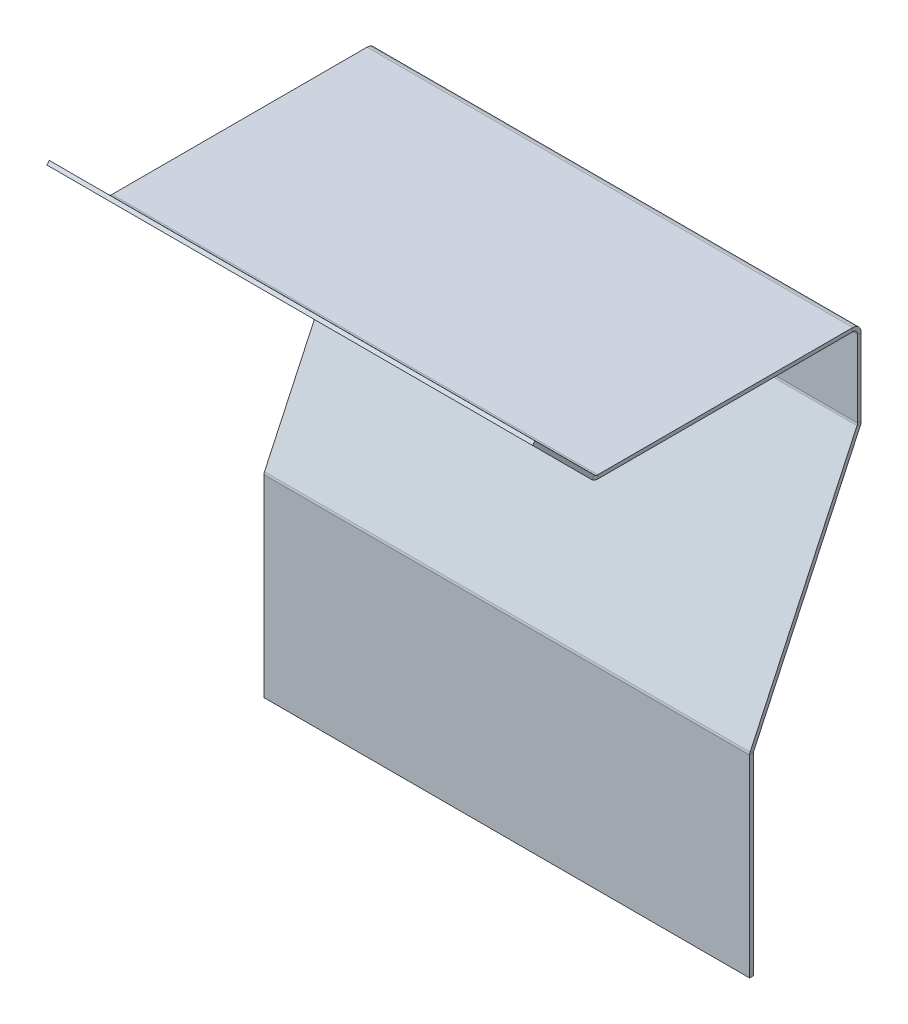
ISO-10303-21;
HEADER;
FILE_DESCRIPTION(('STEP AP214'),'2;1');
FILE_NAME('part.step','',(''),(''),'','','');
FILE_SCHEMA(('AUTOMOTIVE_DESIGN { 1 0 10303 214 1 1 1 1 }'));
ENDSEC;
DATA;
#1=APPLICATION_CONTEXT('core data for automotive mechanical design processes');
#2=APPLICATION_PROTOCOL_DEFINITION('international standard','automotive_design',2000,#1);
#3=PRODUCT_CONTEXT('',#1,'mechanical');
#4=PRODUCT('Part','Part','',(#3));
#5=PRODUCT_RELATED_PRODUCT_CATEGORY('part','',(#4));
#6=PRODUCT_DEFINITION_FORMATION('','',#4);
#7=PRODUCT_DEFINITION_CONTEXT('part definition',#1,'design');
#8=PRODUCT_DEFINITION('design','',#6,#7);
#9=PRODUCT_DEFINITION_SHAPE('','',#8);
#10=(LENGTH_UNIT() NAMED_UNIT(*) SI_UNIT(.MILLI.,.METRE.));
#11=(NAMED_UNIT(*) PLANE_ANGLE_UNIT() SI_UNIT($,.RADIAN.));
#12=(NAMED_UNIT(*) SI_UNIT($,.STERADIAN.) SOLID_ANGLE_UNIT());
#13=UNCERTAINTY_MEASURE_WITH_UNIT(LENGTH_MEASURE(1.E-05),#10,'distance_accuracy_value','');
#14=(GEOMETRIC_REPRESENTATION_CONTEXT(3) GLOBAL_UNCERTAINTY_ASSIGNED_CONTEXT((#13)) GLOBAL_UNIT_ASSIGNED_CONTEXT((#10,
#11,#12)) REPRESENTATION_CONTEXT('',''));
#15=CARTESIAN_POINT('',(0.,0.,0.));
#16=DIRECTION('',(0.,0.,1.));
#17=DIRECTION('',(1.,0.,0.));
#18=AXIS2_PLACEMENT_3D('',#15,#16,#17);
#19=CARTESIAN_POINT('',(100.,-1.524,52.5));
#20=DIRECTION('',(1.,0.,0.));
#21=DIRECTION('',(0.,0.,-1.));
#22=AXIS2_PLACEMENT_3D('',#19,#20,#21);
#23=PLANE('',#22);
#24=DIRECTION('',(0.,0.,-1.));
#25=VECTOR('',#24,1.);
#26=CARTESIAN_POINT('',(100.,0.,52.5));
#27=LINE('',#26,#25);
#28=CARTESIAN_POINT('',(100.,0.,52.5));
#29=VERTEX_POINT('',#28);
#30=CARTESIAN_POINT('',(100.,0.,-52.5));
#31=VERTEX_POINT('',#30);
#32=EDGE_CURVE('E205',#29,#31,#27,.T.);
#33=ORIENTED_EDGE('',*,*,#32,.F.);
#34=DIRECTION('',(0.,1.,0.));
#35=VECTOR('',#34,1.);
#36=CARTESIAN_POINT('',(100.,-1.524,52.5));
#37=LINE('',#36,#35);
#38=CARTESIAN_POINT('',(100.,-1.52400000000003,52.5));
#39=VERTEX_POINT('',#38);
#40=EDGE_CURVE('E13',#39,#29,#37,.T.);
#41=ORIENTED_EDGE('',*,*,#40,.F.);
#42=DIRECTION('',(0.,0.,-1.));
#43=VECTOR('',#42,1.);
#44=CARTESIAN_POINT('',(100.,-1.524,52.5));
#45=LINE('',#44,#43);
#46=CARTESIAN_POINT('',(100.,-1.524,-52.5));
#47=VERTEX_POINT('',#46);
#48=EDGE_CURVE('E181',#39,#47,#45,.T.);
#49=ORIENTED_EDGE('',*,*,#48,.T.);
#50=DIRECTION('',(0.,1.,0.));
#51=VECTOR('',#50,1.);
#52=CARTESIAN_POINT('',(100.,-1.524,-52.5));
#53=LINE('',#52,#51);
#54=EDGE_CURVE('E125',#47,#31,#53,.T.);
#55=ORIENTED_EDGE('',*,*,#54,.T.);
#56=EDGE_LOOP('',(#33,#41,#49,#55));
#57=FACE_BOUND('',#56,.T.);
#58=ADVANCED_FACE('F122',(#57),#23,.T.);
#59=CARTESIAN_POINT('',(-100.,-1.524,52.5));
#60=DIRECTION('',(-1.,0.,0.));
#61=DIRECTION('',(0.,0.,1.));
#62=AXIS2_PLACEMENT_3D('',#59,#60,#61);
#63=PLANE('',#62);
#64=DIRECTION('',(0.,0.,1.));
#65=VECTOR('',#64,1.);
#66=CARTESIAN_POINT('',(-100.,0.,52.5));
#67=LINE('',#66,#65);
#68=CARTESIAN_POINT('',(-100.,0.,-52.5));
#69=VERTEX_POINT('',#68);
#70=CARTESIAN_POINT('',(-100.,0.,52.5));
#71=VERTEX_POINT('',#70);
#72=EDGE_CURVE('E154',#69,#71,#67,.T.);
#73=ORIENTED_EDGE('',*,*,#72,.F.);
#74=DIRECTION('',(0.,1.,0.));
#75=VECTOR('',#74,1.);
#76=CARTESIAN_POINT('',(-100.,-1.524,-52.5));
#77=LINE('',#76,#75);
#78=CARTESIAN_POINT('',(-100.,-1.524,-52.5));
#79=VERTEX_POINT('',#78);
#80=EDGE_CURVE('E160',#79,#69,#77,.T.);
#81=ORIENTED_EDGE('',*,*,#80,.F.);
#82=DIRECTION('',(0.,0.,1.));
#83=VECTOR('',#82,1.);
#84=CARTESIAN_POINT('',(-100.,-1.524,52.5));
#85=LINE('',#84,#83);
#86=CARTESIAN_POINT('',(-100.,-1.524,52.5));
#87=VERTEX_POINT('',#86);
#88=EDGE_CURVE('E139',#79,#87,#85,.T.);
#89=ORIENTED_EDGE('',*,*,#88,.T.);
#90=DIRECTION('',(0.,1.,0.));
#91=VECTOR('',#90,1.);
#92=CARTESIAN_POINT('',(-100.,-1.524,52.5));
#93=LINE('',#92,#91);
#94=EDGE_CURVE('E131',#87,#71,#93,.T.);
#95=ORIENTED_EDGE('',*,*,#94,.T.);
#96=EDGE_LOOP('',(#73,#81,#89,#95));
#97=FACE_BOUND('',#96,.T.);
#98=ADVANCED_FACE('F153',(#97),#63,.T.);
#99=CARTESIAN_POINT('',(0.,-1.524,0.));
#100=DIRECTION('',(0.,-1.,0.));
#101=DIRECTION('',(0.,0.,-1.));
#102=AXIS2_PLACEMENT_3D('',#99,#100,#101);
#103=PLANE('',#102);
#104=ORIENTED_EDGE('',*,*,#48,.F.);
#105=DIRECTION('',(1.,0.,0.));
#106=VECTOR('',#105,1.);
#107=CARTESIAN_POINT('',(-100.,-1.524,52.5));
#108=LINE('',#107,#106);
#109=EDGE_CURVE('E202',#87,#39,#108,.T.);
#110=ORIENTED_EDGE('',*,*,#109,.F.);
#111=ORIENTED_EDGE('',*,*,#88,.F.);
#112=DIRECTION('',(-1.,0.,0.));
#113=VECTOR('',#112,1.);
#114=CARTESIAN_POINT('',(-100.,-1.524,-52.5));
#115=LINE('',#114,#113);
#116=EDGE_CURVE('E198',#47,#79,#115,.T.);
#117=ORIENTED_EDGE('',*,*,#116,.F.);
#118=EDGE_LOOP('',(#104,#110,#111,#117));
#119=FACE_BOUND('',#118,.T.);
#120=ADVANCED_FACE('F245',(#119),#103,.T.);
#121=CARTESIAN_POINT('',(0.,0.,0.));
#122=DIRECTION('',(0.,-1.,0.));
#123=DIRECTION('',(0.,0.,-1.));
#124=AXIS2_PLACEMENT_3D('',#121,#122,#123);
#125=PLANE('',#124);
#126=ORIENTED_EDGE('',*,*,#32,.T.);
#127=DIRECTION('',(-1.,0.,0.));
#128=VECTOR('',#127,1.);
#129=CARTESIAN_POINT('',(-100.,0.,-52.5));
#130=LINE('',#129,#128);
#131=EDGE_CURVE('E169',#31,#69,#130,.T.);
#132=ORIENTED_EDGE('',*,*,#131,.T.);
#133=ORIENTED_EDGE('',*,*,#72,.T.);
#134=DIRECTION('',(1.,0.,0.));
#135=VECTOR('',#134,1.);
#136=CARTESIAN_POINT('',(-100.,0.,52.5));
#137=LINE('',#136,#135);
#138=EDGE_CURVE('E167',#71,#29,#137,.T.);
#139=ORIENTED_EDGE('',*,*,#138,.T.);
#140=EDGE_LOOP('',(#126,#132,#133,#139));
#141=FACE_BOUND('',#140,.T.);
#142=ADVANCED_FACE('F166',(#141),#125,.F.);
#143=CARTESIAN_POINT('',(-100.,1.98119999999999,52.5));
#144=DIRECTION('',(-1.,0.,0.));
#145=DIRECTION('',(0.,-1.,0.));
#146=AXIS2_PLACEMENT_3D('',#143,#144,#145);
#147=PLANE('',#146);
#148=DIRECTION('',(0.,0.707106781186551,-0.707106781186544));
#149=VECTOR('',#148,1.);
#150=CARTESIAN_POINT('',(-100.,-0.49735068941511,54.978550689415));
#151=LINE('',#150,#149);
#152=CARTESIAN_POINT('',(-100.,0.580280045113193,53.9009199548868));
#153=VERTEX_POINT('',#152);
#154=CARTESIAN_POINT('',(-100.,-0.497350689415108,54.9785506894151));
#155=VERTEX_POINT('',#154);
#156=EDGE_CURVE('E186',#153,#155,#151,.F.);
#157=ORIENTED_EDGE('',*,*,#156,.F.);
#158=CARTESIAN_POINT('',(-100.,1.98119999999999,52.5));
#159=DIRECTION('',(1.,0.,0.));
#160=DIRECTION('',(0.,1.,0.));
#161=AXIS2_PLACEMENT_3D('',#158,#159,#160);
#162=CIRCLE('',#161,1.98120000000001);
#163=EDGE_CURVE('E177',#71,#153,#162,.F.);
#164=ORIENTED_EDGE('',*,*,#163,.F.);
#165=ORIENTED_EDGE('',*,*,#94,.F.);
#166=CARTESIAN_POINT('',(-100.,1.98119999999999,52.5));
#167=DIRECTION('',(1.,0.,0.));
#168=DIRECTION('',(0.,1.,0.));
#169=AXIS2_PLACEMENT_3D('',#166,#167,#168);
#170=CIRCLE('',#169,3.50520000000001);
#171=EDGE_CURVE('E190',#87,#155,#170,.F.);
#172=ORIENTED_EDGE('',*,*,#171,.T.);
#173=EDGE_LOOP('',(#157,#164,#165,#172));
#174=FACE_BOUND('',#173,.T.);
#175=ADVANCED_FACE('F184',(#174),#147,.T.);
#176=CARTESIAN_POINT('',(100.,1.98119999999997,52.5));
#177=DIRECTION('',(-1.,0.,0.));
#178=DIRECTION('',(0.,-1.,0.));
#179=AXIS2_PLACEMENT_3D('',#176,#177,#178);
#180=PLANE('',#179);
#181=CARTESIAN_POINT('',(100.,1.98119999999997,52.5));
#182=DIRECTION('',(1.,0.,0.));
#183=DIRECTION('',(0.,1.,0.));
#184=AXIS2_PLACEMENT_3D('',#181,#182,#183);
#185=CIRCLE('',#184,1.98120000000001);
#186=CARTESIAN_POINT('',(100.,0.580280045113173,53.9009199548868));
#187=VERTEX_POINT('',#186);
#188=EDGE_CURVE('E180',#187,#29,#185,.T.);
#189=ORIENTED_EDGE('',*,*,#188,.F.);
#190=DIRECTION('',(0.,0.707106781186551,-0.707106781186544));
#191=VECTOR('',#190,1.);
#192=CARTESIAN_POINT('',(100.,0.5802800451132,53.9009199548867));
#193=LINE('',#192,#191);
#194=CARTESIAN_POINT('',(100.,-0.497350689415114,54.9785506894151));
#195=VERTEX_POINT('',#194);
#196=EDGE_CURVE('E277',#187,#195,#193,.F.);
#197=ORIENTED_EDGE('',*,*,#196,.T.);
#198=CARTESIAN_POINT('',(100.,1.98119999999997,52.5));
#199=DIRECTION('',(1.,0.,0.));
#200=DIRECTION('',(0.,1.,0.));
#201=AXIS2_PLACEMENT_3D('',#198,#199,#200);
#202=CIRCLE('',#201,3.50520000000001);
#203=EDGE_CURVE('E187',#195,#39,#202,.T.);
#204=ORIENTED_EDGE('',*,*,#203,.T.);
#205=ORIENTED_EDGE('',*,*,#40,.T.);
#206=EDGE_LOOP('',(#189,#197,#204,#205));
#207=FACE_BOUND('',#206,.T.);
#208=ADVANCED_FACE('F282',(#207),#180,.F.);
#209=CARTESIAN_POINT('',(100.,1.98119999999997,52.5));
#210=DIRECTION('',(1.,0.,0.));
#211=DIRECTION('',(0.,-0.707106781186551,0.707106781186544));
#212=AXIS2_PLACEMENT_3D('',#209,#210,#211);
#213=CYLINDRICAL_SURFACE('',#212,3.50520000000001);
#214=ORIENTED_EDGE('',*,*,#109,.T.);
#215=ORIENTED_EDGE('',*,*,#203,.F.);
#216=DIRECTION('',(1.,0.,0.));
#217=VECTOR('',#216,1.);
#218=CARTESIAN_POINT('',(-100.,-0.497350689415114,54.978550689415));
#219=LINE('',#218,#217);
#220=EDGE_CURVE('E291',#195,#155,#219,.F.);
#221=ORIENTED_EDGE('',*,*,#220,.T.);
#222=ORIENTED_EDGE('',*,*,#171,.F.);
#223=EDGE_LOOP('',(#214,#215,#221,#222));
#224=FACE_BOUND('',#223,.T.);
#225=ADVANCED_FACE('F347',(#224),#213,.T.);
#226=CARTESIAN_POINT('',(100.,1.98119999999997,52.5));
#227=DIRECTION('',(1.,0.,0.));
#228=DIRECTION('',(0.,-0.707106781186551,0.707106781186544));
#229=AXIS2_PLACEMENT_3D('',#226,#227,#228);
#230=CYLINDRICAL_SURFACE('',#229,1.98120000000001);
#231=ORIENTED_EDGE('',*,*,#138,.F.);
#232=ORIENTED_EDGE('',*,*,#163,.T.);
#233=DIRECTION('',(1.,0.,0.));
#234=VECTOR('',#233,1.);
#235=CARTESIAN_POINT('',(-100.,0.580280045113188,53.9009199548868));
#236=LINE('',#235,#234);
#237=EDGE_CURVE('E272',#153,#187,#236,.T.);
#238=ORIENTED_EDGE('',*,*,#237,.T.);
#239=ORIENTED_EDGE('',*,*,#188,.T.);
#240=EDGE_LOOP('',(#231,#232,#238,#239));
#241=FACE_BOUND('',#240,.T.);
#242=ADVANCED_FACE('F174',(#241),#230,.F.);
#243=CARTESIAN_POINT('',(100.,23.9318441227156,79.407745501546));
#244=DIRECTION('',(-1.,0.,0.));
#245=DIRECTION('',(0.,0.,1.));
#246=AXIS2_PLACEMENT_3D('',#243,#244,#245);
#247=PLANE('',#246);
#248=ORIENTED_EDGE('',*,*,#196,.F.);
#249=DIRECTION('',(0.,-0.707106781186544,-0.707106781186551));
#250=VECTOR('',#249,1.);
#251=CARTESIAN_POINT('',(100.,25.0094748572439,78.3301147670177));
#252=LINE('',#251,#250);
#253=CARTESIAN_POINT('',(100.,25.0094748572439,78.3301147670177));
#254=VERTEX_POINT('',#253);
#255=EDGE_CURVE('E288',#187,#254,#252,.F.);
#256=ORIENTED_EDGE('',*,*,#255,.T.);
#257=DIRECTION('',(0.,0.707106781186551,-0.707106781186544));
#258=VECTOR('',#257,1.);
#259=CARTESIAN_POINT('',(100.,23.9318441227156,79.407745501546));
#260=LINE('',#259,#258);
#261=CARTESIAN_POINT('',(100.,23.9318441227156,79.407745501546));
#262=VERTEX_POINT('',#261);
#263=EDGE_CURVE('E192',#262,#254,#260,.T.);
#264=ORIENTED_EDGE('',*,*,#263,.F.);
#265=DIRECTION('',(0.,0.707106781186544,0.707106781186551));
#266=VECTOR('',#265,1.);
#267=CARTESIAN_POINT('',(100.,-27.3276307345283,28.1482706443016));
#268=LINE('',#267,#266);
#269=EDGE_CURVE('E290',#195,#262,#268,.T.);
#270=ORIENTED_EDGE('',*,*,#269,.F.);
#271=EDGE_LOOP('',(#248,#256,#264,#270));
#272=FACE_BOUND('',#271,.T.);
#273=ADVANCED_FACE('F286',(#272),#247,.F.);
#274=CARTESIAN_POINT('',(-100.,-1.07763073452831,54.3982706443018));
#275=DIRECTION('',(1.,0.,0.));
#276=DIRECTION('',(0.,0.,-1.));
#277=AXIS2_PLACEMENT_3D('',#274,#275,#276);
#278=PLANE('',#277);
#279=ORIENTED_EDGE('',*,*,#156,.T.);
#280=DIRECTION('',(0.,-0.707106781186544,-0.707106781186551));
#281=VECTOR('',#280,1.);
#282=CARTESIAN_POINT('',(-100.,-27.3276307345283,28.1482706443016));
#283=LINE('',#282,#281);
#284=CARTESIAN_POINT('',(-100.,23.9318441227156,79.407745501546));
#285=VERTEX_POINT('',#284);
#286=EDGE_CURVE('E309',#285,#155,#283,.T.);
#287=ORIENTED_EDGE('',*,*,#286,.F.);
#288=DIRECTION('',(0.,0.707106781186551,-0.707106781186544));
#289=VECTOR('',#288,1.);
#290=CARTESIAN_POINT('',(-100.,23.9318441227156,79.407745501546));
#291=LINE('',#290,#289);
#292=CARTESIAN_POINT('',(-100.,25.0094748572439,78.3301147670177));
#293=VERTEX_POINT('',#292);
#294=EDGE_CURVE('E315',#285,#293,#291,.T.);
#295=ORIENTED_EDGE('',*,*,#294,.T.);
#296=DIRECTION('',(0.,0.707106781186544,0.707106781186551));
#297=VECTOR('',#296,1.);
#298=CARTESIAN_POINT('',(-100.,0.,53.3206399097736));
#299=LINE('',#298,#297);
#300=EDGE_CURVE('E297',#293,#153,#299,.F.);
#301=ORIENTED_EDGE('',*,*,#300,.T.);
#302=EDGE_LOOP('',(#279,#287,#295,#301));
#303=FACE_BOUND('',#302,.T.);
#304=ADVANCED_FACE('F307',(#303),#278,.F.);
#305=CARTESIAN_POINT('',(0.,-27.3276307345283,28.1482706443016));
#306=DIRECTION('',(0.,0.707106781186551,-0.707106781186544));
#307=DIRECTION('',(0.,0.707106781186544,0.707106781186551));
#308=AXIS2_PLACEMENT_3D('',#305,#306,#307);
#309=PLANE('',#308);
#310=ORIENTED_EDGE('',*,*,#220,.F.);
#311=ORIENTED_EDGE('',*,*,#269,.T.);
#312=DIRECTION('',(-1.,0.,0.));
#313=VECTOR('',#312,1.);
#314=CARTESIAN_POINT('',(0.,23.9318441227156,79.407745501546));
#315=LINE('',#314,#313);
#316=EDGE_CURVE('E313',#262,#285,#315,.T.);
#317=ORIENTED_EDGE('',*,*,#316,.T.);
#318=ORIENTED_EDGE('',*,*,#286,.T.);
#319=EDGE_LOOP('',(#310,#311,#317,#318));
#320=FACE_BOUND('',#319,.T.);
#321=ADVANCED_FACE('F311',(#320),#309,.F.);
#322=CARTESIAN_POINT('',(0.,-26.25,27.0706399097733));
#323=DIRECTION('',(0.,0.707106781186551,-0.707106781186544));
#324=DIRECTION('',(0.,0.707106781186544,0.707106781186551));
#325=AXIS2_PLACEMENT_3D('',#322,#323,#324);
#326=PLANE('',#325);
#327=ORIENTED_EDGE('',*,*,#255,.F.);
#328=ORIENTED_EDGE('',*,*,#237,.F.);
#329=ORIENTED_EDGE('',*,*,#300,.F.);
#330=DIRECTION('',(1.,0.,0.));
#331=VECTOR('',#330,1.);
#332=CARTESIAN_POINT('',(-100.,25.0094748572439,78.3301147670177));
#333=LINE('',#332,#331);
#334=EDGE_CURVE('E295',#254,#293,#333,.F.);
#335=ORIENTED_EDGE('',*,*,#334,.F.);
#336=EDGE_LOOP('',(#327,#328,#329,#335));
#337=FACE_BOUND('',#336,.T.);
#338=ADVANCED_FACE('F294',(#337),#326,.T.);
#339=CARTESIAN_POINT('',(-100.,23.9318441227156,79.407745501546));
#340=DIRECTION('',(0.,-0.707106781186544,-0.707106781186551));
#341=DIRECTION('',(0.,0.707106781186551,-0.707106781186544));
#342=AXIS2_PLACEMENT_3D('',#339,#340,#341);
#343=PLANE('',#342);
#344=ORIENTED_EDGE('',*,*,#334,.T.);
#345=ORIENTED_EDGE('',*,*,#294,.F.);
#346=ORIENTED_EDGE('',*,*,#316,.F.);
#347=ORIENTED_EDGE('',*,*,#263,.T.);
#348=EDGE_LOOP('',(#344,#345,#346,#347));
#349=FACE_BOUND('',#348,.T.);
#350=ADVANCED_FACE('F322',(#349),#343,.F.);
#351=CARTESIAN_POINT('',(-100.,-3.50520000000001,-52.5));
#352=DIRECTION('',(-1.,0.,0.));
#353=DIRECTION('',(0.,0.,1.));
#354=AXIS2_PLACEMENT_3D('',#351,#352,#353);
#355=PLANE('',#354);
#356=DIRECTION('',(0.,0.,1.));
#357=VECTOR('',#356,1.);
#358=CARTESIAN_POINT('',(-100.,-3.50519999999998,-56.0052));
#359=LINE('',#358,#357);
#360=CARTESIAN_POINT('',(-100.,-3.5052,-54.4812));
#361=VERTEX_POINT('',#360);
#362=CARTESIAN_POINT('',(-100.,-3.50519999999999,-56.0052));
#363=VERTEX_POINT('',#362);
#364=EDGE_CURVE('E555',#361,#363,#359,.F.);
#365=ORIENTED_EDGE('',*,*,#364,.F.);
#366=CARTESIAN_POINT('',(-100.,-3.50520000000001,-52.5));
#367=DIRECTION('',(1.,0.,0.));
#368=DIRECTION('',(0.,0.,-1.));
#369=AXIS2_PLACEMENT_3D('',#366,#367,#368);
#370=CIRCLE('',#369,1.9812);
#371=EDGE_CURVE('E241',#79,#361,#370,.F.);
#372=ORIENTED_EDGE('',*,*,#371,.F.);
#373=ORIENTED_EDGE('',*,*,#80,.T.);
#374=CARTESIAN_POINT('',(-100.,-3.50520000000001,-52.5));
#375=DIRECTION('',(1.,0.,0.));
#376=DIRECTION('',(0.,0.,-1.));
#377=AXIS2_PLACEMENT_3D('',#374,#375,#376);
#378=CIRCLE('',#377,3.5052);
#379=EDGE_CURVE('E302',#69,#363,#378,.F.);
#380=ORIENTED_EDGE('',*,*,#379,.T.);
#381=EDGE_LOOP('',(#365,#372,#373,#380));
#382=FACE_BOUND('',#381,.T.);
#383=ADVANCED_FACE('F324',(#382),#355,.T.);
#384=CARTESIAN_POINT('',(100.,-3.50520000000001,-52.5));
#385=DIRECTION('',(-1.,0.,0.));
#386=DIRECTION('',(0.,0.,1.));
#387=AXIS2_PLACEMENT_3D('',#384,#385,#386);
#388=PLANE('',#387);
#389=CARTESIAN_POINT('',(100.,-3.50520000000001,-52.5));
#390=DIRECTION('',(1.,0.,0.));
#391=DIRECTION('',(0.,0.,-1.));
#392=AXIS2_PLACEMENT_3D('',#389,#390,#391);
#393=CIRCLE('',#392,1.9812);
#394=CARTESIAN_POINT('',(100.,-3.5052,-54.4812));
#395=VERTEX_POINT('',#394);
#396=EDGE_CURVE('E228',#395,#47,#393,.T.);
#397=ORIENTED_EDGE('',*,*,#396,.F.);
#398=DIRECTION('',(0.,0.,1.));
#399=VECTOR('',#398,1.);
#400=CARTESIAN_POINT('',(100.,-3.50519999999999,-54.4812));
#401=LINE('',#400,#399);
#402=CARTESIAN_POINT('',(100.,-3.50519999999998,-56.0052));
#403=VERTEX_POINT('',#402);
#404=EDGE_CURVE('E589',#395,#403,#401,.F.);
#405=ORIENTED_EDGE('',*,*,#404,.T.);
#406=CARTESIAN_POINT('',(100.,-3.50520000000001,-52.5));
#407=DIRECTION('',(1.,0.,0.));
#408=DIRECTION('',(0.,0.,-1.));
#409=AXIS2_PLACEMENT_3D('',#406,#407,#408);
#410=CIRCLE('',#409,3.5052);
#411=EDGE_CURVE('E231',#403,#31,#410,.T.);
#412=ORIENTED_EDGE('',*,*,#411,.T.);
#413=ORIENTED_EDGE('',*,*,#54,.F.);
#414=EDGE_LOOP('',(#397,#405,#412,#413));
#415=FACE_BOUND('',#414,.T.);
#416=ADVANCED_FACE('F225',(#415),#388,.F.);
#417=CARTESIAN_POINT('',(100.,-3.50520000000001,-52.5));
#418=DIRECTION('',(1.,0.,0.));
#419=DIRECTION('',(0.,0.,-1.));
#420=AXIS2_PLACEMENT_3D('',#417,#418,#419);
#421=CYLINDRICAL_SURFACE('',#420,3.5052);
#422=ORIENTED_EDGE('',*,*,#131,.F.);
#423=ORIENTED_EDGE('',*,*,#411,.F.);
#424=DIRECTION('',(1.,0.,0.));
#425=VECTOR('',#424,1.);
#426=CARTESIAN_POINT('',(-100.,-3.50519999999998,-56.0052));
#427=LINE('',#426,#425);
#428=EDGE_CURVE('E587',#403,#363,#427,.F.);
#429=ORIENTED_EDGE('',*,*,#428,.T.);
#430=ORIENTED_EDGE('',*,*,#379,.F.);
#431=EDGE_LOOP('',(#422,#423,#429,#430));
#432=FACE_BOUND('',#431,.T.);
#433=ADVANCED_FACE('F363',(#432),#421,.T.);
#434=CARTESIAN_POINT('',(100.,-3.50520000000001,-52.5));
#435=DIRECTION('',(1.,0.,0.));
#436=DIRECTION('',(0.,0.,-1.));
#437=AXIS2_PLACEMENT_3D('',#434,#435,#436);
#438=CYLINDRICAL_SURFACE('',#437,1.9812);
#439=ORIENTED_EDGE('',*,*,#116,.T.);
#440=ORIENTED_EDGE('',*,*,#371,.T.);
#441=DIRECTION('',(1.,0.,0.));
#442=VECTOR('',#441,1.);
#443=CARTESIAN_POINT('',(-100.,-3.50519999999999,-54.4812));
#444=LINE('',#443,#442);
#445=EDGE_CURVE('E240',#361,#395,#444,.T.);
#446=ORIENTED_EDGE('',*,*,#445,.T.);
#447=ORIENTED_EDGE('',*,*,#396,.T.);
#448=EDGE_LOOP('',(#439,#440,#446,#447));
#449=FACE_BOUND('',#448,.T.);
#450=ADVANCED_FACE('F237',(#449),#438,.F.);
#451=CARTESIAN_POINT('',(100.,-35.,-56.0052000000001));
#452=DIRECTION('',(-1.,0.,0.));
#453=DIRECTION('',(0.,0.,1.));
#454=AXIS2_PLACEMENT_3D('',#451,#452,#453);
#455=PLANE('',#454);
#456=ORIENTED_EDGE('',*,*,#404,.F.);
#457=DIRECTION('',(0.,1.,0.));
#458=VECTOR('',#457,1.);
#459=CARTESIAN_POINT('',(100.,-35.,-54.4812000000001));
#460=LINE('',#459,#458);
#461=CARTESIAN_POINT('',(100.,-35.,-54.4812000000004));
#462=VERTEX_POINT('',#461);
#463=EDGE_CURVE('E584',#395,#462,#460,.F.);
#464=ORIENTED_EDGE('',*,*,#463,.T.);
#465=DIRECTION('',(0.,0.,1.));
#466=VECTOR('',#465,1.);
#467=CARTESIAN_POINT('',(100.,-35.,-56.0052000000001));
#468=LINE('',#467,#466);
#469=CARTESIAN_POINT('',(100.,-35.,-56.0052000000004));
#470=VERTEX_POINT('',#469);
#471=EDGE_CURVE('E242',#470,#462,#468,.T.);
#472=ORIENTED_EDGE('',*,*,#471,.F.);
#473=DIRECTION('',(0.,-1.,0.));
#474=VECTOR('',#473,1.);
#475=CARTESIAN_POINT('',(100.,1.90318114263623E-13,-56.0052));
#476=LINE('',#475,#474);
#477=EDGE_CURVE('E575',#403,#470,#476,.T.);
#478=ORIENTED_EDGE('',*,*,#477,.F.);
#479=EDGE_LOOP('',(#456,#464,#472,#478));
#480=FACE_BOUND('',#479,.T.);
#481=ADVANCED_FACE('F367',(#480),#455,.F.);
#482=CARTESIAN_POINT('',(-100.,-1.52399999999999,-56.0052));
#483=DIRECTION('',(1.,0.,0.));
#484=DIRECTION('',(0.,0.,-1.));
#485=AXIS2_PLACEMENT_3D('',#482,#483,#484);
#486=PLANE('',#485);
#487=ORIENTED_EDGE('',*,*,#364,.T.);
#488=DIRECTION('',(0.,1.,0.));
#489=VECTOR('',#488,1.);
#490=CARTESIAN_POINT('',(-100.,1.90318114263623E-13,-56.0052));
#491=LINE('',#490,#489);
#492=CARTESIAN_POINT('',(-100.,-35.,-56.0052000000001));
#493=VERTEX_POINT('',#492);
#494=EDGE_CURVE('E569',#493,#363,#491,.T.);
#495=ORIENTED_EDGE('',*,*,#494,.F.);
#496=DIRECTION('',(0.,0.,1.));
#497=VECTOR('',#496,1.);
#498=CARTESIAN_POINT('',(-100.,-35.,-56.0052000000001));
#499=LINE('',#498,#497);
#500=CARTESIAN_POINT('',(-100.,-35.,-54.4812000000001));
#501=VERTEX_POINT('',#500);
#502=EDGE_CURVE('E566',#493,#501,#499,.T.);
#503=ORIENTED_EDGE('',*,*,#502,.T.);
#504=DIRECTION('',(0.,-1.,0.));
#505=VECTOR('',#504,1.);
#506=CARTESIAN_POINT('',(-100.,-1.524,-54.4812));
#507=LINE('',#506,#505);
#508=EDGE_CURVE('E578',#501,#361,#507,.F.);
#509=ORIENTED_EDGE('',*,*,#508,.T.);
#510=EDGE_LOOP('',(#487,#495,#503,#509));
#511=FACE_BOUND('',#510,.T.);
#512=ADVANCED_FACE('F373',(#511),#486,.F.);
#513=CARTESIAN_POINT('',(0.,1.90318114263623E-13,-56.0052));
#514=DIRECTION('',(0.,0.,1.));
#515=DIRECTION('',(0.,-1.,0.));
#516=AXIS2_PLACEMENT_3D('',#513,#514,#515);
#517=PLANE('',#516);
#518=ORIENTED_EDGE('',*,*,#428,.F.);
#519=ORIENTED_EDGE('',*,*,#477,.T.);
#520=DIRECTION('',(-1.,0.,0.));
#521=VECTOR('',#520,1.);
#522=CARTESIAN_POINT('',(0.,-35.,-56.0052000000001));
#523=LINE('',#522,#521);
#524=EDGE_CURVE('E572',#470,#493,#523,.T.);
#525=ORIENTED_EDGE('',*,*,#524,.T.);
#526=ORIENTED_EDGE('',*,*,#494,.T.);
#527=EDGE_LOOP('',(#518,#519,#525,#526));
#528=FACE_BOUND('',#527,.T.);
#529=ADVANCED_FACE('F377',(#528),#517,.F.);
#530=CARTESIAN_POINT('',(0.,1.84997096703226E-13,-54.4812));
#531=DIRECTION('',(0.,0.,1.));
#532=DIRECTION('',(0.,-1.,0.));
#533=AXIS2_PLACEMENT_3D('',#530,#531,#532);
#534=PLANE('',#533);
#535=ORIENTED_EDGE('',*,*,#463,.F.);
#536=ORIENTED_EDGE('',*,*,#445,.F.);
#537=ORIENTED_EDGE('',*,*,#508,.F.);
#538=DIRECTION('',(1.,0.,0.));
#539=VECTOR('',#538,1.);
#540=CARTESIAN_POINT('',(-100.,-35.,-54.4812000000001));
#541=LINE('',#540,#539);
#542=EDGE_CURVE('E581',#462,#501,#541,.F.);
#543=ORIENTED_EDGE('',*,*,#542,.F.);
#544=EDGE_LOOP('',(#535,#536,#537,#543));
#545=FACE_BOUND('',#544,.T.);
#546=ADVANCED_FACE('F379',(#545),#534,.T.);
#547=CARTESIAN_POINT('',(-100.,-35.,-52.5));
#548=DIRECTION('',(-1.,0.,0.));
#549=DIRECTION('',(0.,0.,1.));
#550=AXIS2_PLACEMENT_3D('',#547,#548,#549);
#551=PLANE('',#550);
#552=DIRECTION('',(0.,0.422618261740691,0.906307787036654));
#553=VECTOR('',#552,1.);
#554=CARTESIAN_POINT('',(-100.,-36.4813615310535,-55.676790055121));
#555=LINE('',#554,#553);
#556=CARTESIAN_POINT('',(-100.,-35.8372913001607,-54.2955769876771));
#557=VERTEX_POINT('',#556);
#558=CARTESIAN_POINT('',(-100.,-36.4813615310535,-55.676790055121));
#559=VERTEX_POINT('',#558);
#560=EDGE_CURVE('E506',#557,#559,#555,.F.);
#561=ORIENTED_EDGE('',*,*,#560,.F.);
#562=CARTESIAN_POINT('',(-100.,-35.,-52.5));
#563=DIRECTION('',(1.,0.,0.));
#564=DIRECTION('',(0.,0.,-1.));
#565=AXIS2_PLACEMENT_3D('',#562,#563,#564);
#566=CIRCLE('',#565,1.98120000000015);
#567=EDGE_CURVE('E559',#501,#557,#566,.F.);
#568=ORIENTED_EDGE('',*,*,#567,.F.);
#569=ORIENTED_EDGE('',*,*,#502,.F.);
#570=CARTESIAN_POINT('',(-100.,-35.,-52.5));
#571=DIRECTION('',(1.,0.,0.));
#572=DIRECTION('',(0.,0.,-1.));
#573=AXIS2_PLACEMENT_3D('',#570,#571,#572);
#574=CIRCLE('',#573,3.50520000000015);
#575=EDGE_CURVE('E552',#493,#559,#574,.F.);
#576=ORIENTED_EDGE('',*,*,#575,.T.);
#577=EDGE_LOOP('',(#561,#568,#569,#576));
#578=FACE_BOUND('',#577,.T.);
#579=ADVANCED_FACE('F382',(#578),#551,.T.);
#580=CARTESIAN_POINT('',(100.,-35.,-52.5000000000003));
#581=DIRECTION('',(-1.,0.,0.));
#582=DIRECTION('',(0.,0.,1.));
#583=AXIS2_PLACEMENT_3D('',#580,#581,#582);
#584=PLANE('',#583);
#585=CARTESIAN_POINT('',(100.,-35.,-52.5000000000003));
#586=DIRECTION('',(1.,0.,0.));
#587=DIRECTION('',(0.,0.,-1.));
#588=AXIS2_PLACEMENT_3D('',#585,#586,#587);
#589=CIRCLE('',#588,1.98120000000015);
#590=CARTESIAN_POINT('',(100.,-35.8372913001607,-54.2955769876775));
#591=VERTEX_POINT('',#590);
#592=EDGE_CURVE('E519',#591,#462,#589,.T.);
#593=ORIENTED_EDGE('',*,*,#592,.F.);
#594=DIRECTION('',(0.,0.422618261740691,0.906307787036654));
#595=VECTOR('',#594,1.);
#596=CARTESIAN_POINT('',(100.,-35.8372913001607,-54.2955769876771));
#597=LINE('',#596,#595);
#598=CARTESIAN_POINT('',(100.,-36.4813615310535,-55.676790055121));
#599=VERTEX_POINT('',#598);
#600=EDGE_CURVE('E544',#591,#599,#597,.F.);
#601=ORIENTED_EDGE('',*,*,#600,.T.);
#602=CARTESIAN_POINT('',(100.,-35.,-52.5000000000003));
#603=DIRECTION('',(1.,0.,0.));
#604=DIRECTION('',(0.,0.,-1.));
#605=AXIS2_PLACEMENT_3D('',#602,#603,#604);
#606=CIRCLE('',#605,3.50520000000015);
#607=EDGE_CURVE('E556',#599,#470,#606,.T.);
#608=ORIENTED_EDGE('',*,*,#607,.T.);
#609=ORIENTED_EDGE('',*,*,#471,.T.);
#610=EDGE_LOOP('',(#593,#601,#608,#609));
#611=FACE_BOUND('',#610,.T.);
#612=ADVANCED_FACE('F387',(#611),#584,.F.);
#613=CARTESIAN_POINT('',(100.,-35.,-52.5000000000003));
#614=DIRECTION('',(1.,0.,0.));
#615=DIRECTION('',(0.,-0.422618261740691,-0.906307787036654));
#616=AXIS2_PLACEMENT_3D('',#613,#614,#615);
#617=CYLINDRICAL_SURFACE('',#616,3.50520000000015);
#618=ORIENTED_EDGE('',*,*,#524,.F.);
#619=ORIENTED_EDGE('',*,*,#607,.F.);
#620=DIRECTION('',(1.,0.,0.));
#621=VECTOR('',#620,1.);
#622=CARTESIAN_POINT('',(-100.,-36.4813615310535,-55.676790055121));
#623=LINE('',#622,#621);
#624=EDGE_CURVE('E541',#599,#559,#623,.F.);
#625=ORIENTED_EDGE('',*,*,#624,.T.);
#626=ORIENTED_EDGE('',*,*,#575,.F.);
#627=EDGE_LOOP('',(#618,#619,#625,#626));
#628=FACE_BOUND('',#627,.T.);
#629=ADVANCED_FACE('F390',(#628),#617,.T.);
#630=CARTESIAN_POINT('',(100.,-35.,-52.5000000000003));
#631=DIRECTION('',(1.,0.,0.));
#632=DIRECTION('',(0.,-0.422618261740691,-0.906307787036654));
#633=AXIS2_PLACEMENT_3D('',#630,#631,#632);
#634=CYLINDRICAL_SURFACE('',#633,1.98120000000015);
#635=ORIENTED_EDGE('',*,*,#542,.T.);
#636=ORIENTED_EDGE('',*,*,#567,.T.);
#637=DIRECTION('',(1.,0.,0.));
#638=VECTOR('',#637,1.);
#639=CARTESIAN_POINT('',(-100.,-35.8372913001607,-54.2955769876771));
#640=LINE('',#639,#638);
#641=EDGE_CURVE('E547',#557,#591,#640,.T.);
#642=ORIENTED_EDGE('',*,*,#641,.T.);
#643=ORIENTED_EDGE('',*,*,#592,.T.);
#644=EDGE_LOOP('',(#635,#636,#642,#643));
#645=FACE_BOUND('',#644,.T.);
#646=ADVANCED_FACE('F395',(#645),#634,.F.);
#647=CARTESIAN_POINT('',(100.,-130.939401770345,-11.6302825172276));
#648=DIRECTION('',(-1.,0.,0.));
#649=DIRECTION('',(0.,0.,1.));
#650=AXIS2_PLACEMENT_3D('',#647,#648,#649);
#651=PLANE('',#650);
#652=ORIENTED_EDGE('',*,*,#600,.F.);
#653=DIRECTION('',(0.,0.906307787036654,-0.422618261740691));
#654=VECTOR('',#653,1.);
#655=CARTESIAN_POINT('',(100.,-130.295331539452,-10.2490694497837));
#656=LINE('',#655,#654);
#657=CARTESIAN_POINT('',(100.,-130.295331539452,-10.2490694497838));
#658=VERTEX_POINT('',#657);
#659=EDGE_CURVE('E538',#591,#658,#656,.F.);
#660=ORIENTED_EDGE('',*,*,#659,.T.);
#661=DIRECTION('',(0.,0.422618261740691,0.906307787036654));
#662=VECTOR('',#661,1.);
#663=CARTESIAN_POINT('',(100.,-130.939401770345,-11.6302825172276));
#664=LINE('',#663,#662);
#665=CARTESIAN_POINT('',(100.,-130.939401770345,-11.6302825172276));
#666=VERTEX_POINT('',#665);
#667=EDGE_CURVE('E516',#666,#658,#664,.T.);
#668=ORIENTED_EDGE('',*,*,#667,.F.);
#669=DIRECTION('',(0.,-0.906307787036654,0.422618261740691));
#670=VECTOR('',#669,1.);
#671=CARTESIAN_POINT('',(100.,-28.2020187842328,-59.5375109824534));
#672=LINE('',#671,#670);
#673=EDGE_CURVE('E529',#599,#666,#672,.T.);
#674=ORIENTED_EDGE('',*,*,#673,.F.);
#675=EDGE_LOOP('',(#652,#660,#668,#674));
#676=FACE_BOUND('',#675,.T.);
#677=ADVANCED_FACE('F398',(#676),#651,.F.);
#678=CARTESIAN_POINT('',(-100.,-36.083291696521,-55.862413067444));
#679=DIRECTION('',(1.,0.,0.));
#680=DIRECTION('',(0.,0.,-1.));
#681=AXIS2_PLACEMENT_3D('',#678,#679,#680);
#682=PLANE('',#681);
#683=ORIENTED_EDGE('',*,*,#560,.T.);
#684=DIRECTION('',(0.,0.906307787036654,-0.422618261740691));
#685=VECTOR('',#684,1.);
#686=CARTESIAN_POINT('',(-100.,-28.2020187842328,-59.5375109824534));
#687=LINE('',#686,#685);
#688=CARTESIAN_POINT('',(-100.,-130.939401770345,-11.6302825172276));
#689=VERTEX_POINT('',#688);
#690=EDGE_CURVE('E523',#689,#559,#687,.T.);
#691=ORIENTED_EDGE('',*,*,#690,.F.);
#692=DIRECTION('',(0.,0.422618261740691,0.906307787036654));
#693=VECTOR('',#692,1.);
#694=CARTESIAN_POINT('',(-100.,-130.939401770345,-11.6302825172276));
#695=LINE('',#694,#693);
#696=CARTESIAN_POINT('',(-100.,-130.295331539452,-10.2490694497839));
#697=VERTEX_POINT('',#696);
#698=EDGE_CURVE('E520',#689,#697,#695,.T.);
#699=ORIENTED_EDGE('',*,*,#698,.T.);
#700=DIRECTION('',(0.,-0.906307787036654,0.422618261740691));
#701=VECTOR('',#700,1.);
#702=CARTESIAN_POINT('',(-100.,-35.4392214656282,-54.4812000000001));
#703=LINE('',#702,#701);
#704=EDGE_CURVE('E532',#697,#557,#703,.F.);
#705=ORIENTED_EDGE('',*,*,#704,.T.);
#706=EDGE_LOOP('',(#683,#691,#699,#705));
#707=FACE_BOUND('',#706,.T.);
#708=ADVANCED_FACE('F405',(#707),#682,.F.);
#709=CARTESIAN_POINT('',(0.,-28.2020187842328,-59.5375109824534));
#710=DIRECTION('',(0.,0.422618261740691,0.906307787036654));
#711=DIRECTION('',(0.,-0.906307787036654,0.422618261740691));
#712=AXIS2_PLACEMENT_3D('',#709,#710,#711);
#713=PLANE('',#712);
#714=ORIENTED_EDGE('',*,*,#624,.F.);
#715=ORIENTED_EDGE('',*,*,#673,.T.);
#716=DIRECTION('',(-1.,0.,0.));
#717=VECTOR('',#716,1.);
#718=CARTESIAN_POINT('',(0.,-130.939401770345,-11.6302825172276));
#719=LINE('',#718,#717);
#720=EDGE_CURVE('E526',#666,#689,#719,.T.);
#721=ORIENTED_EDGE('',*,*,#720,.T.);
#722=ORIENTED_EDGE('',*,*,#690,.T.);
#723=EDGE_LOOP('',(#714,#715,#721,#722));
#724=FACE_BOUND('',#723,.T.);
#725=ADVANCED_FACE('F409',(#724),#713,.F.);
#726=CARTESIAN_POINT('',(0.,-27.55794855334,-58.1562979150095));
#727=DIRECTION('',(0.,0.422618261740691,0.906307787036654));
#728=DIRECTION('',(0.,-0.906307787036654,0.422618261740691));
#729=AXIS2_PLACEMENT_3D('',#726,#727,#728);
#730=PLANE('',#729);
#731=ORIENTED_EDGE('',*,*,#659,.F.);
#732=ORIENTED_EDGE('',*,*,#641,.F.);
#733=ORIENTED_EDGE('',*,*,#704,.F.);
#734=DIRECTION('',(1.,0.,0.));
#735=VECTOR('',#734,1.);
#736=CARTESIAN_POINT('',(-100.,-130.295331539452,-10.2490694497837));
#737=LINE('',#736,#735);
#738=EDGE_CURVE('E535',#658,#697,#737,.F.);
#739=ORIENTED_EDGE('',*,*,#738,.F.);
#740=EDGE_LOOP('',(#731,#732,#733,#739));
#741=FACE_BOUND('',#740,.T.);
#742=ADVANCED_FACE('F411',(#741),#730,.T.);
#743=CARTESIAN_POINT('',(100.,-131.250702381943,-12.2978688331588));
#744=DIRECTION('',(1.,0.,0.));
#745=DIRECTION('',(0.,0.,-1.));
#746=AXIS2_PLACEMENT_3D('',#743,#744,#745);
#747=PLANE('',#746);
#748=DIRECTION('',(0.,0.,-1.));
#749=VECTOR('',#748,1.);
#750=CARTESIAN_POINT('',(100.,-131.250702381943,-10.0372688331588));
#751=LINE('',#750,#749);
#752=CARTESIAN_POINT('',(100.,-131.250702381943,-11.5612688331588));
#753=VERTEX_POINT('',#752);
#754=CARTESIAN_POINT('',(100.,-131.250702381943,-10.0372688331588));
#755=VERTEX_POINT('',#754);
#756=EDGE_CURVE('E501',#753,#755,#751,.F.);
#757=ORIENTED_EDGE('',*,*,#756,.F.);
#758=CARTESIAN_POINT('',(100.,-131.250702381943,-12.2978688331588));
#759=DIRECTION('',(-1.,0.,0.));
#760=DIRECTION('',(0.,0.,1.));
#761=AXIS2_PLACEMENT_3D('',#758,#759,#760);
#762=CIRCLE('',#761,0.736599999999962);
#763=EDGE_CURVE('E510',#666,#753,#762,.F.);
#764=ORIENTED_EDGE('',*,*,#763,.F.);
#765=ORIENTED_EDGE('',*,*,#667,.T.);
#766=CARTESIAN_POINT('',(100.,-131.250702381943,-12.2978688331588));
#767=DIRECTION('',(-1.,0.,0.));
#768=DIRECTION('',(0.,0.,1.));
#769=AXIS2_PLACEMENT_3D('',#766,#767,#768);
#770=CIRCLE('',#769,2.26059999999996);
#771=EDGE_CURVE('E504',#658,#755,#770,.F.);
#772=ORIENTED_EDGE('',*,*,#771,.T.);
#773=EDGE_LOOP('',(#757,#764,#765,#772));
#774=FACE_BOUND('',#773,.T.);
#775=ADVANCED_FACE('F414',(#774),#747,.T.);
#776=CARTESIAN_POINT('',(-100.,-131.250702381943,-12.297868833159));
#777=DIRECTION('',(1.,0.,0.));
#778=DIRECTION('',(0.,0.,-1.));
#779=AXIS2_PLACEMENT_3D('',#776,#777,#778);
#780=PLANE('',#779);
#781=CARTESIAN_POINT('',(-100.,-131.250702381943,-12.297868833159));
#782=DIRECTION('',(-1.,0.,0.));
#783=DIRECTION('',(0.,0.,1.));
#784=AXIS2_PLACEMENT_3D('',#781,#782,#783);
#785=CIRCLE('',#784,0.736599999999962);
#786=CARTESIAN_POINT('',(-100.,-131.250702381943,-11.561268833159));
#787=VERTEX_POINT('',#786);
#788=EDGE_CURVE('E513',#787,#689,#785,.T.);
#789=ORIENTED_EDGE('',*,*,#788,.F.);
#790=DIRECTION('',(0.,0.,-1.));
#791=VECTOR('',#790,1.);
#792=CARTESIAN_POINT('',(-100.,-131.250702381943,-11.5612688331588));
#793=LINE('',#792,#791);
#794=CARTESIAN_POINT('',(-100.,-131.250702381943,-10.0372688331588));
#795=VERTEX_POINT('',#794);
#796=EDGE_CURVE('E475',#787,#795,#793,.F.);
#797=ORIENTED_EDGE('',*,*,#796,.T.);
#798=CARTESIAN_POINT('',(-100.,-131.250702381943,-12.297868833159));
#799=DIRECTION('',(-1.,0.,0.));
#800=DIRECTION('',(0.,0.,1.));
#801=AXIS2_PLACEMENT_3D('',#798,#799,#800);
#802=CIRCLE('',#801,2.26059999999996);
#803=EDGE_CURVE('E507',#795,#697,#802,.T.);
#804=ORIENTED_EDGE('',*,*,#803,.T.);
#805=ORIENTED_EDGE('',*,*,#698,.F.);
#806=EDGE_LOOP('',(#789,#797,#804,#805));
#807=FACE_BOUND('',#806,.T.);
#808=ADVANCED_FACE('F419',(#807),#780,.F.);
#809=CARTESIAN_POINT('',(-100.,-131.250702381943,-12.297868833159));
#810=DIRECTION('',(-1.,0.,0.));
#811=DIRECTION('',(0.,0.,1.));
#812=AXIS2_PLACEMENT_3D('',#809,#810,#811);
#813=CYLINDRICAL_SURFACE('',#812,2.26059999999996);
#814=ORIENTED_EDGE('',*,*,#738,.T.);
#815=ORIENTED_EDGE('',*,*,#803,.F.);
#816=DIRECTION('',(-1.,0.,0.));
#817=VECTOR('',#816,1.);
#818=CARTESIAN_POINT('',(100.,-131.250702381943,-10.0372688331588));
#819=LINE('',#818,#817);
#820=EDGE_CURVE('E460',#795,#755,#819,.F.);
#821=ORIENTED_EDGE('',*,*,#820,.T.);
#822=ORIENTED_EDGE('',*,*,#771,.F.);
#823=EDGE_LOOP('',(#814,#815,#821,#822));
#824=FACE_BOUND('',#823,.T.);
#825=ADVANCED_FACE('F422',(#824),#813,.T.);
#826=CARTESIAN_POINT('',(-100.,-131.250702381943,-12.297868833159));
#827=DIRECTION('',(-1.,0.,0.));
#828=DIRECTION('',(0.,0.,1.));
#829=AXIS2_PLACEMENT_3D('',#826,#827,#828);
#830=CYLINDRICAL_SURFACE('',#829,0.736599999999962);
#831=ORIENTED_EDGE('',*,*,#720,.F.);
#832=ORIENTED_EDGE('',*,*,#763,.T.);
#833=DIRECTION('',(-1.,0.,0.));
#834=VECTOR('',#833,1.);
#835=CARTESIAN_POINT('',(100.,-131.250702381943,-11.5612688331588));
#836=LINE('',#835,#834);
#837=EDGE_CURVE('E498',#753,#787,#836,.T.);
#838=ORIENTED_EDGE('',*,*,#837,.T.);
#839=ORIENTED_EDGE('',*,*,#788,.T.);
#840=EDGE_LOOP('',(#831,#832,#838,#839));
#841=FACE_BOUND('',#840,.T.);
#842=ADVANCED_FACE('F427',(#841),#830,.F.);
#843=CARTESIAN_POINT('',(-100.,-210.749539427572,-10.0372688331591));
#844=DIRECTION('',(1.,0.,0.));
#845=DIRECTION('',(0.,1.,0.));
#846=AXIS2_PLACEMENT_3D('',#843,#844,#845);
#847=PLANE('',#846);
#848=ORIENTED_EDGE('',*,*,#796,.F.);
#849=DIRECTION('',(0.,1.,0.));
#850=VECTOR('',#849,1.);
#851=CARTESIAN_POINT('',(-100.,-210.749539427572,-11.5612688331591));
#852=LINE('',#851,#850);
#853=CARTESIAN_POINT('',(-100.,-210.749539427572,-11.5612688331591));
#854=VERTEX_POINT('',#853);
#855=EDGE_CURVE('E474',#787,#854,#852,.F.);
#856=ORIENTED_EDGE('',*,*,#855,.T.);
#857=DIRECTION('',(0.,0.,-1.));
#858=VECTOR('',#857,1.);
#859=CARTESIAN_POINT('',(-100.,-210.749539427572,-10.0372688331591));
#860=LINE('',#859,#858);
#861=CARTESIAN_POINT('',(-100.,-210.749539427572,-10.0372688331591));
#862=VERTEX_POINT('',#861);
#863=EDGE_CURVE('E483',#862,#854,#860,.T.);
#864=ORIENTED_EDGE('',*,*,#863,.F.);
#865=DIRECTION('',(0.,-1.,0.));
#866=VECTOR('',#865,1.);
#867=CARTESIAN_POINT('',(-100.,-0.14800032309539,-10.0372688331583));
#868=LINE('',#867,#866);
#869=EDGE_CURVE('E464',#795,#862,#868,.T.);
#870=ORIENTED_EDGE('',*,*,#869,.F.);
#871=EDGE_LOOP('',(#848,#856,#864,#870));
#872=FACE_BOUND('',#871,.T.);
#873=ADVANCED_FACE('F430',(#872),#847,.F.);
#874=CARTESIAN_POINT('',(100.,-131.08740209344,-10.0372688331588));
#875=DIRECTION('',(-1.,0.,0.));
#876=DIRECTION('',(0.,-1.,0.));
#877=AXIS2_PLACEMENT_3D('',#874,#875,#876);
#878=PLANE('',#877);
#879=ORIENTED_EDGE('',*,*,#756,.T.);
#880=DIRECTION('',(0.,1.,0.));
#881=VECTOR('',#880,1.);
#882=CARTESIAN_POINT('',(100.,-0.148000323095355,-10.0372688331584));
#883=LINE('',#882,#881);
#884=CARTESIAN_POINT('',(100.,-210.749539427572,-10.0372688331591));
#885=VERTEX_POINT('',#884);
#886=EDGE_CURVE('E468',#885,#755,#883,.T.);
#887=ORIENTED_EDGE('',*,*,#886,.F.);
#888=DIRECTION('',(0.,0.,-1.));
#889=VECTOR('',#888,1.);
#890=CARTESIAN_POINT('',(100.,-210.749539427572,-10.0372688331591));
#891=LINE('',#890,#889);
#892=CARTESIAN_POINT('',(100.,-210.749539427572,-11.5612688331591));
#893=VERTEX_POINT('',#892);
#894=EDGE_CURVE('E663',#885,#893,#891,.T.);
#895=ORIENTED_EDGE('',*,*,#894,.T.);
#896=DIRECTION('',(0.,-1.,0.));
#897=VECTOR('',#896,1.);
#898=CARTESIAN_POINT('',(100.,-131.08740209344,-11.5612688331588));
#899=LINE('',#898,#897);
#900=EDGE_CURVE('E486',#893,#753,#899,.F.);
#901=ORIENTED_EDGE('',*,*,#900,.T.);
#902=EDGE_LOOP('',(#879,#887,#895,#901));
#903=FACE_BOUND('',#902,.T.);
#904=ADVANCED_FACE('F437',(#903),#878,.F.);
#905=CARTESIAN_POINT('',(0.,-0.148000323095373,-10.0372688331584));
#906=DIRECTION('',(0.,0.,-1.));
#907=DIRECTION('',(0.,1.,0.));
#908=AXIS2_PLACEMENT_3D('',#905,#906,#907);
#909=PLANE('',#908);
#910=ORIENTED_EDGE('',*,*,#820,.F.);
#911=ORIENTED_EDGE('',*,*,#869,.T.);
#912=DIRECTION('',(1.,0.,0.));
#913=VECTOR('',#912,1.);
#914=CARTESIAN_POINT('',(0.,-210.749539427572,-10.0372688331591));
#915=LINE('',#914,#913);
#916=EDGE_CURVE('E485',#862,#885,#915,.T.);
#917=ORIENTED_EDGE('',*,*,#916,.T.);
#918=ORIENTED_EDGE('',*,*,#886,.T.);
#919=EDGE_LOOP('',(#910,#911,#917,#918));
#920=FACE_BOUND('',#919,.T.);
#921=ADVANCED_FACE('F446',(#920),#909,.F.);
#922=CARTESIAN_POINT('',(0.,-0.148000323095367,-11.5612688331583));
#923=DIRECTION('',(0.,0.,-1.));
#924=DIRECTION('',(0.,1.,0.));
#925=AXIS2_PLACEMENT_3D('',#922,#923,#924);
#926=PLANE('',#925);
#927=ORIENTED_EDGE('',*,*,#855,.F.);
#928=ORIENTED_EDGE('',*,*,#837,.F.);
#929=ORIENTED_EDGE('',*,*,#900,.F.);
#930=DIRECTION('',(-1.,0.,0.));
#931=VECTOR('',#930,1.);
#932=CARTESIAN_POINT('',(100.,-210.749539427572,-11.5612688331591));
#933=LINE('',#932,#931);
#934=EDGE_CURVE('E490',#854,#893,#933,.F.);
#935=ORIENTED_EDGE('',*,*,#934,.F.);
#936=EDGE_LOOP('',(#927,#928,#929,#935));
#937=FACE_BOUND('',#936,.T.);
#938=ADVANCED_FACE('F442',(#937),#926,.T.);
#939=CARTESIAN_POINT('',(100.,-210.749539427572,-10.0372688331591));
#940=DIRECTION('',(0.,1.,0.));
#941=DIRECTION('',(0.,0.,1.));
#942=AXIS2_PLACEMENT_3D('',#939,#940,#941);
#943=PLANE('',#942);
#944=ORIENTED_EDGE('',*,*,#934,.T.);
#945=ORIENTED_EDGE('',*,*,#894,.F.);
#946=ORIENTED_EDGE('',*,*,#916,.F.);
#947=ORIENTED_EDGE('',*,*,#863,.T.);
#948=EDGE_LOOP('',(#944,#945,#946,#947));
#949=FACE_BOUND('',#948,.T.);
#950=ADVANCED_FACE('F439',(#949),#943,.F.);
#951=CLOSED_SHELL('',(#58,#98,#120,#142,#175,#208,#225,#242,#273,#304,#321,#338,#350,#383,#416,
#433,#450,#481,#512,#529,#546,#579,#612,#629,#646,#677,#708,#725,#742,#775,#808,#825,#842,#873,
#904,#921,#938,#950));
#952=MANIFOLD_SOLID_BREP('B2',#951);
#953=ADVANCED_BREP_SHAPE_REPRESENTATION('',(#18,#952),#14);
#954=SHAPE_DEFINITION_REPRESENTATION(#9,#953);
ENDSEC;
END-ISO-10303-21;
